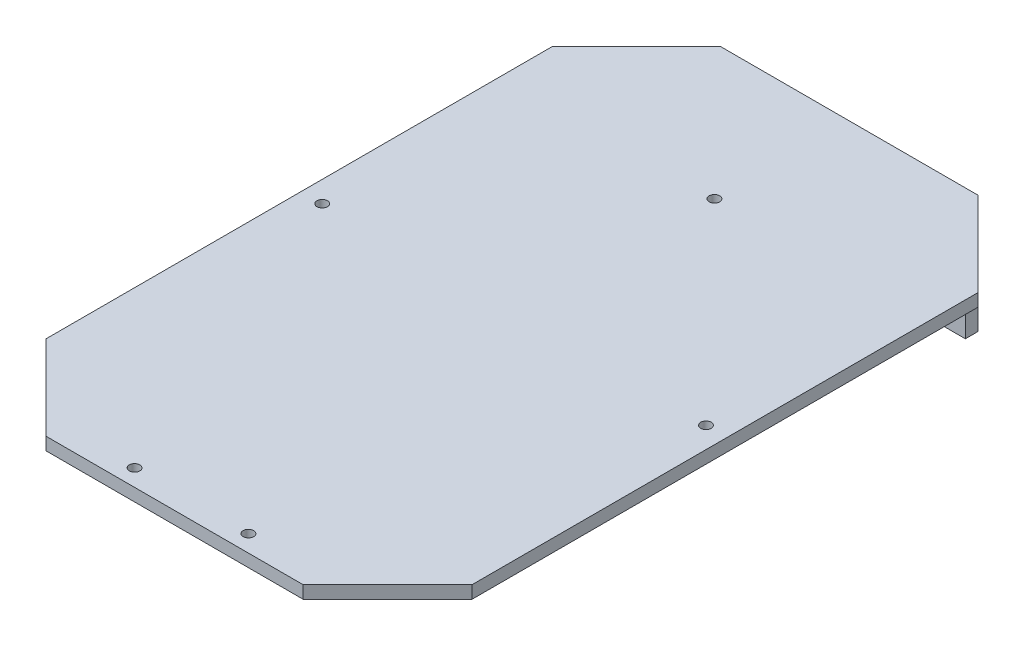
ISO-10303-21;
HEADER;
FILE_DESCRIPTION(('STEP AP214'),'2;1');
FILE_NAME('part.step','',(''),(''),'','','');
FILE_SCHEMA(('AUTOMOTIVE_DESIGN { 1 0 10303 214 1 1 1 1 }'));
ENDSEC;
DATA;
#1=APPLICATION_CONTEXT('core data for automotive mechanical design processes');
#2=APPLICATION_PROTOCOL_DEFINITION('international standard','automotive_design',2000,#1);
#3=PRODUCT_CONTEXT('',#1,'mechanical');
#4=PRODUCT('Part','Part','',(#3));
#5=PRODUCT_RELATED_PRODUCT_CATEGORY('part','',(#4));
#6=PRODUCT_DEFINITION_FORMATION('','',#4);
#7=PRODUCT_DEFINITION_CONTEXT('part definition',#1,'design');
#8=PRODUCT_DEFINITION('design','',#6,#7);
#9=PRODUCT_DEFINITION_SHAPE('','',#8);
#10=(LENGTH_UNIT() NAMED_UNIT(*) SI_UNIT(.MILLI.,.METRE.));
#11=(NAMED_UNIT(*) PLANE_ANGLE_UNIT() SI_UNIT($,.RADIAN.));
#12=(NAMED_UNIT(*) SI_UNIT($,.STERADIAN.) SOLID_ANGLE_UNIT());
#13=UNCERTAINTY_MEASURE_WITH_UNIT(LENGTH_MEASURE(1.E-05),#10,'distance_accuracy_value','');
#14=(GEOMETRIC_REPRESENTATION_CONTEXT(3) GLOBAL_UNCERTAINTY_ASSIGNED_CONTEXT((#13)) GLOBAL_UNIT_ASSIGNED_CONTEXT((#10,
#11,#12)) REPRESENTATION_CONTEXT('',''));
#15=CARTESIAN_POINT('',(0.,0.,0.));
#16=DIRECTION('',(0.,0.,1.));
#17=DIRECTION('',(1.,0.,0.));
#18=AXIS2_PLACEMENT_3D('',#15,#16,#17);
#19=CARTESIAN_POINT('',(0.,0.,0.));
#20=DIRECTION('',(0.,1.,0.));
#21=DIRECTION('',(0.,0.,1.));
#22=AXIS2_PLACEMENT_3D('',#19,#20,#21);
#23=PLANE('',#22);
#24=CARTESIAN_POINT('',(15.2297414645355,0.,21.5463266374892));
#25=DIRECTION('',(0.,1.,0.));
#26=DIRECTION('',(0.,0.,1.));
#27=AXIS2_PLACEMENT_3D('',#24,#25,#26);
#28=CIRCLE('',#27,1.25);
#29=CARTESIAN_POINT('',(15.2297414645355,0.,22.7963266374892));
#30=VERTEX_POINT('',#29);
#31=EDGE_CURVE('E167',#30,#30,#28,.T.);
#32=ORIENTED_EDGE('',*,*,#31,.T.);
#33=EDGE_LOOP('',(#32));
#34=FACE_BOUND('',#33,.T.);
#35=CARTESIAN_POINT('',(-75.7702585354645,0.,21.5463266374893));
#36=DIRECTION('',(0.,1.,0.));
#37=DIRECTION('',(0.,0.,1.));
#38=AXIS2_PLACEMENT_3D('',#35,#36,#37);
#39=CIRCLE('',#38,1.25000000000001);
#40=CARTESIAN_POINT('',(-75.7702585354645,0.,22.7963266374893));
#41=VERTEX_POINT('',#40);
#42=EDGE_CURVE('E163',#41,#41,#39,.T.);
#43=ORIENTED_EDGE('',*,*,#42,.T.);
#44=EDGE_LOOP('',(#43));
#45=FACE_BOUND('',#44,.T.);
#46=CARTESIAN_POINT('',(-30.2702585354645,0.,-25.9536733625108));
#47=DIRECTION('',(0.,1.,0.));
#48=DIRECTION('',(0.,0.,1.));
#49=AXIS2_PLACEMENT_3D('',#46,#47,#48);
#50=CIRCLE('',#49,1.25);
#51=CARTESIAN_POINT('',(-30.2702585354645,0.,-24.7036733625108));
#52=VERTEX_POINT('',#51);
#53=EDGE_CURVE('E159',#52,#52,#50,.T.);
#54=ORIENTED_EDGE('',*,*,#53,.T.);
#55=EDGE_LOOP('',(#54));
#56=FACE_BOUND('',#55,.T.);
#57=CARTESIAN_POINT('',(-43.7702585354645,0.,98.0463266374892));
#58=DIRECTION('',(0.,1.,0.));
#59=DIRECTION('',(0.,0.,1.));
#60=AXIS2_PLACEMENT_3D('',#57,#58,#59);
#61=CIRCLE('',#60,1.25);
#62=CARTESIAN_POINT('',(-43.7702585354645,0.,99.2963266374892));
#63=VERTEX_POINT('',#62);
#64=EDGE_CURVE('E155',#63,#63,#61,.T.);
#65=ORIENTED_EDGE('',*,*,#64,.T.);
#66=EDGE_LOOP('',(#65));
#67=FACE_BOUND('',#66,.T.);
#68=CARTESIAN_POINT('',(-16.7702585354645,0.,98.0463266374892));
#69=DIRECTION('',(0.,1.,0.));
#70=DIRECTION('',(0.,0.,1.));
#71=AXIS2_PLACEMENT_3D('',#68,#69,#70);
#72=CIRCLE('',#71,1.25);
#73=CARTESIAN_POINT('',(-16.7702585354645,0.,99.2963266374892));
#74=VERTEX_POINT('',#73);
#75=EDGE_CURVE('E146',#74,#74,#72,.T.);
#76=ORIENTED_EDGE('',*,*,#75,.T.);
#77=EDGE_LOOP('',(#76));
#78=FACE_BOUND('',#77,.T.);
#79=DIRECTION('',(0.,0.,1.));
#80=VECTOR('',#79,1.);
#81=CARTESIAN_POINT('',(0.22974146453553,0.,-57.9536733625108));
#82=LINE('',#81,#80);
#83=CARTESIAN_POINT('',(0.22974146453553,0.,-57.9536733625108));
#84=VERTEX_POINT('',#83);
#85=CARTESIAN_POINT('',(0.22974146453553,0.,-54.9536733625107));
#86=VERTEX_POINT('',#85);
#87=EDGE_CURVE('E142',#84,#86,#82,.T.);
#88=ORIENTED_EDGE('',*,*,#87,.F.);
#89=DIRECTION('',(-0.707106781186547,0.,-0.707106781186549));
#90=VECTOR('',#89,1.);
#91=CARTESIAN_POINT('',(0.229741464535541,0.,-57.9536733625108));
#92=LINE('',#91,#90);
#93=CARTESIAN_POINT('',(20.2297414645355,0.,-37.9536733625107));
#94=VERTEX_POINT('',#93);
#95=EDGE_CURVE('E205',#84,#94,#92,.F.);
#96=ORIENTED_EDGE('',*,*,#95,.T.);
#97=DIRECTION('',(0.,0.,-1.));
#98=VECTOR('',#97,1.);
#99=CARTESIAN_POINT('',(20.2297414645355,0.,-57.9536733625108));
#100=LINE('',#99,#98);
#101=CARTESIAN_POINT('',(20.2297414645355,0.,82.0463266374892));
#102=VERTEX_POINT('',#101);
#103=EDGE_CURVE('E172',#102,#94,#100,.T.);
#104=ORIENTED_EDGE('',*,*,#103,.F.);
#105=DIRECTION('',(0.707106781186549,0.,-0.707106781186547));
#106=VECTOR('',#105,1.);
#107=CARTESIAN_POINT('',(20.2297414645355,0.,82.0463266374893));
#108=LINE('',#107,#106);
#109=CARTESIAN_POINT('',(0.229741464535457,0.,102.046326637489));
#110=VERTEX_POINT('',#109);
#111=EDGE_CURVE('E207',#102,#110,#108,.F.);
#112=ORIENTED_EDGE('',*,*,#111,.T.);
#113=DIRECTION('',(1.,0.,0.));
#114=VECTOR('',#113,1.);
#115=CARTESIAN_POINT('',(-80.7702585354645,0.,102.046326637489));
#116=LINE('',#115,#114);
#117=CARTESIAN_POINT('',(-60.7702585354644,0.,102.046326637489));
#118=VERTEX_POINT('',#117);
#119=EDGE_CURVE('E184',#118,#110,#116,.T.);
#120=ORIENTED_EDGE('',*,*,#119,.F.);
#121=DIRECTION('',(0.707106781186547,0.,0.707106781186549));
#122=VECTOR('',#121,1.);
#123=CARTESIAN_POINT('',(-60.7702585354644,0.,102.046326637489));
#124=LINE('',#123,#122);
#125=CARTESIAN_POINT('',(-80.7702585354645,0.,82.0463266374892));
#126=VERTEX_POINT('',#125);
#127=EDGE_CURVE('E209',#118,#126,#124,.F.);
#128=ORIENTED_EDGE('',*,*,#127,.T.);
#129=DIRECTION('',(0.,0.,1.));
#130=VECTOR('',#129,1.);
#131=CARTESIAN_POINT('',(-80.7702585354645,0.,-57.9536733625108));
#132=LINE('',#131,#130);
#133=CARTESIAN_POINT('',(-80.7702585354645,0.,-37.9536733625108));
#134=VERTEX_POINT('',#133);
#135=EDGE_CURVE('E181',#134,#126,#132,.T.);
#136=ORIENTED_EDGE('',*,*,#135,.F.);
#137=DIRECTION('',(-0.707106781186549,0.,0.707106781186547));
#138=VECTOR('',#137,1.);
#139=CARTESIAN_POINT('',(-80.7702585354645,0.,-37.9536733625108));
#140=LINE('',#139,#138);
#141=CARTESIAN_POINT('',(-60.7702585354644,0.,-57.9536733625108));
#142=VERTEX_POINT('',#141);
#143=EDGE_CURVE('E203',#134,#142,#140,.F.);
#144=ORIENTED_EDGE('',*,*,#143,.T.);
#145=DIRECTION('',(0.,0.,-1.));
#146=VECTOR('',#145,1.);
#147=CARTESIAN_POINT('',(-60.7702585354644,0.,-57.9536733625108));
#148=LINE('',#147,#146);
#149=CARTESIAN_POINT('',(-60.7702585354644,0.,-54.9536733625108));
#150=VERTEX_POINT('',#149);
#151=EDGE_CURVE('E139',#150,#142,#148,.T.);
#152=ORIENTED_EDGE('',*,*,#151,.F.);
#153=DIRECTION('',(-1.,0.,0.));
#154=VECTOR('',#153,1.);
#155=CARTESIAN_POINT('',(0.22974146453553,0.,-54.9536733625107));
#156=LINE('',#155,#154);
#157=EDGE_CURVE('E51',#86,#150,#156,.T.);
#158=ORIENTED_EDGE('',*,*,#157,.F.);
#159=EDGE_LOOP('',(#88,#96,#104,#112,#120,#128,#136,#144,#152,#158));
#160=FACE_BOUND('',#159,.T.);
#161=ADVANCED_FACE('F34',(#34,#45,#56,#67,#78,#160),#23,.F.);
#162=CARTESIAN_POINT('',(-80.7702585354645,3.,-57.9536733625108));
#163=DIRECTION('',(1.,0.,0.));
#164=DIRECTION('',(0.,0.,-1.));
#165=AXIS2_PLACEMENT_3D('',#162,#163,#164);
#166=PLANE('',#165);
#167=ORIENTED_EDGE('',*,*,#135,.T.);
#168=DIRECTION('',(0.,1.,0.));
#169=VECTOR('',#168,1.);
#170=CARTESIAN_POINT('',(-80.7702585354645,3.,82.0463266374892));
#171=LINE('',#170,#169);
#172=CARTESIAN_POINT('',(-80.7702585354645,3.,82.0463266374892));
#173=VERTEX_POINT('',#172);
#174=EDGE_CURVE('E214',#126,#173,#171,.T.);
#175=ORIENTED_EDGE('',*,*,#174,.T.);
#176=DIRECTION('',(0.,0.,1.));
#177=VECTOR('',#176,1.);
#178=CARTESIAN_POINT('',(-80.7702585354645,3.,-57.9536733625108));
#179=LINE('',#178,#177);
#180=CARTESIAN_POINT('',(-80.7702585354645,3.,-37.9536733625108));
#181=VERTEX_POINT('',#180);
#182=EDGE_CURVE('E168',#181,#173,#179,.T.);
#183=ORIENTED_EDGE('',*,*,#182,.F.);
#184=DIRECTION('',(0.,-1.,0.));
#185=VECTOR('',#184,1.);
#186=CARTESIAN_POINT('',(-80.7702585354645,3.,-37.9536733625108));
#187=LINE('',#186,#185);
#188=EDGE_CURVE('E211',#181,#134,#187,.T.);
#189=ORIENTED_EDGE('',*,*,#188,.T.);
#190=EDGE_LOOP('',(#167,#175,#183,#189));
#191=FACE_BOUND('',#190,.T.);
#192=ADVANCED_FACE('F274',(#191),#166,.F.);
#193=CARTESIAN_POINT('',(-80.7702585354645,3.,102.046326637489));
#194=DIRECTION('',(0.,0.,-1.));
#195=DIRECTION('',(-1.,0.,0.));
#196=AXIS2_PLACEMENT_3D('',#193,#194,#195);
#197=PLANE('',#196);
#198=DIRECTION('',(1.,0.,0.));
#199=VECTOR('',#198,1.);
#200=CARTESIAN_POINT('',(-80.7702585354645,3.,102.046326637489));
#201=LINE('',#200,#199);
#202=CARTESIAN_POINT('',(-60.7702585354645,3.,102.046326637489));
#203=VERTEX_POINT('',#202);
#204=CARTESIAN_POINT('',(0.229741464535426,3.,102.046326637489));
#205=VERTEX_POINT('',#204);
#206=EDGE_CURVE('E171',#203,#205,#201,.T.);
#207=ORIENTED_EDGE('',*,*,#206,.F.);
#208=DIRECTION('',(0.,-1.,0.));
#209=VECTOR('',#208,1.);
#210=CARTESIAN_POINT('',(-60.7702585354644,3.,102.046326637489));
#211=LINE('',#210,#209);
#212=EDGE_CURVE('E200',#203,#118,#211,.T.);
#213=ORIENTED_EDGE('',*,*,#212,.T.);
#214=ORIENTED_EDGE('',*,*,#119,.T.);
#215=DIRECTION('',(0.,1.,0.));
#216=VECTOR('',#215,1.);
#217=CARTESIAN_POINT('',(0.229741464535485,3.,102.046326637489));
#218=LINE('',#217,#216);
#219=EDGE_CURVE('E180',#110,#205,#218,.T.);
#220=ORIENTED_EDGE('',*,*,#219,.T.);
#221=EDGE_LOOP('',(#207,#213,#214,#220));
#222=FACE_BOUND('',#221,.T.);
#223=ADVANCED_FACE('F282',(#222),#197,.F.);
#224=CARTESIAN_POINT('',(20.2297414645355,3.,-57.9536733625108));
#225=DIRECTION('',(-1.,0.,0.));
#226=DIRECTION('',(0.,0.,1.));
#227=AXIS2_PLACEMENT_3D('',#224,#225,#226);
#228=PLANE('',#227);
#229=DIRECTION('',(0.,0.,-1.));
#230=VECTOR('',#229,1.);
#231=CARTESIAN_POINT('',(20.2297414645355,3.,-57.9536733625108));
#232=LINE('',#231,#230);
#233=CARTESIAN_POINT('',(20.2297414645355,3.,82.0463266374892));
#234=VERTEX_POINT('',#233);
#235=CARTESIAN_POINT('',(20.2297414645355,3.,-37.9536733625107));
#236=VERTEX_POINT('',#235);
#237=EDGE_CURVE('E175',#234,#236,#232,.T.);
#238=ORIENTED_EDGE('',*,*,#237,.F.);
#239=DIRECTION('',(0.,-1.,0.));
#240=VECTOR('',#239,1.);
#241=CARTESIAN_POINT('',(20.2297414645355,3.,82.0463266374893));
#242=LINE('',#241,#240);
#243=EDGE_CURVE('E226',#234,#102,#242,.T.);
#244=ORIENTED_EDGE('',*,*,#243,.T.);
#245=ORIENTED_EDGE('',*,*,#103,.T.);
#246=DIRECTION('',(0.,1.,0.));
#247=VECTOR('',#246,1.);
#248=CARTESIAN_POINT('',(20.2297414645355,3.,-37.9536733625107));
#249=LINE('',#248,#247);
#250=EDGE_CURVE('E224',#94,#236,#249,.T.);
#251=ORIENTED_EDGE('',*,*,#250,.T.);
#252=EDGE_LOOP('',(#238,#244,#245,#251));
#253=FACE_BOUND('',#252,.T.);
#254=ADVANCED_FACE('F291',(#253),#228,.F.);
#255=CARTESIAN_POINT('',(-80.7702585354645,3.,-57.9536733625108));
#256=DIRECTION('',(0.,0.,1.));
#257=DIRECTION('',(1.,0.,0.));
#258=AXIS2_PLACEMENT_3D('',#255,#256,#257);
#259=PLANE('',#258);
#260=CARTESIAN_POINT('',(-50.7702585354644,-5.5,-57.9536733625108));
#261=DIRECTION('',(0.,0.,-1.));
#262=DIRECTION('',(1.,0.,0.));
#263=AXIS2_PLACEMENT_3D('',#260,#261,#262);
#264=CIRCLE('',#263,0.499999999999999);
#265=CARTESIAN_POINT('',(-50.2702585354644,-5.5,-57.9536733625108));
#266=VERTEX_POINT('',#265);
#267=EDGE_CURVE('E249',#266,#266,#264,.T.);
#268=ORIENTED_EDGE('',*,*,#267,.F.);
#269=EDGE_LOOP('',(#268));
#270=FACE_BOUND('',#269,.T.);
#271=CARTESIAN_POINT('',(-9.77025853546447,-21.,-57.9536733625108));
#272=DIRECTION('',(0.,0.,-1.));
#273=DIRECTION('',(-1.,0.,0.));
#274=AXIS2_PLACEMENT_3D('',#271,#272,#273);
#275=CIRCLE('',#274,0.499999999999999);
#276=CARTESIAN_POINT('',(-10.2702585354645,-21.,-57.9536733625108));
#277=VERTEX_POINT('',#276);
#278=EDGE_CURVE('E239',#277,#277,#275,.T.);
#279=ORIENTED_EDGE('',*,*,#278,.F.);
#280=EDGE_LOOP('',(#279));
#281=FACE_BOUND('',#280,.T.);
#282=CARTESIAN_POINT('',(-50.7702585354644,-21.,-57.9536733625108));
#283=DIRECTION('',(0.,0.,-1.));
#284=DIRECTION('',(1.,0.,0.));
#285=AXIS2_PLACEMENT_3D('',#282,#283,#284);
#286=CIRCLE('',#285,0.499999999999999);
#287=CARTESIAN_POINT('',(-50.2702585354644,-21.,-57.9536733625108));
#288=VERTEX_POINT('',#287);
#289=EDGE_CURVE('E236',#288,#288,#286,.T.);
#290=ORIENTED_EDGE('',*,*,#289,.F.);
#291=EDGE_LOOP('',(#290));
#292=FACE_BOUND('',#291,.T.);
#293=CARTESIAN_POINT('',(-9.77025853546447,-5.5,-57.9536733625108));
#294=DIRECTION('',(0.,0.,-1.));
#295=DIRECTION('',(-1.,0.,0.));
#296=AXIS2_PLACEMENT_3D('',#293,#294,#295);
#297=CIRCLE('',#296,0.499999999999999);
#298=CARTESIAN_POINT('',(-10.2702585354645,-5.5,-57.9536733625108));
#299=VERTEX_POINT('',#298);
#300=EDGE_CURVE('E233',#299,#299,#297,.T.);
#301=ORIENTED_EDGE('',*,*,#300,.F.);
#302=EDGE_LOOP('',(#301));
#303=FACE_BOUND('',#302,.T.);
#304=DIRECTION('',(-1.,0.,0.));
#305=VECTOR('',#304,1.);
#306=CARTESIAN_POINT('',(-80.7702585354645,3.,-57.9536733625108));
#307=LINE('',#306,#305);
#308=CARTESIAN_POINT('',(0.229741464535508,3.,-57.9536733625108));
#309=VERTEX_POINT('',#308);
#310=CARTESIAN_POINT('',(-60.7702585354644,3.,-57.9536733625108));
#311=VERTEX_POINT('',#310);
#312=EDGE_CURVE('E178',#309,#311,#307,.T.);
#313=ORIENTED_EDGE('',*,*,#312,.F.);
#314=DIRECTION('',(0.,-1.,0.));
#315=VECTOR('',#314,1.);
#316=CARTESIAN_POINT('',(0.229741464535541,3.,-57.9536733625108));
#317=LINE('',#316,#315);
#318=EDGE_CURVE('E11',#309,#84,#317,.T.);
#319=ORIENTED_EDGE('',*,*,#318,.T.);
#320=DIRECTION('',(0.,1.,0.));
#321=VECTOR('',#320,1.);
#322=CARTESIAN_POINT('',(0.22974146453553,-25.,-57.9536733625108));
#323=LINE('',#322,#321);
#324=CARTESIAN_POINT('',(0.22974146453553,-25.,-57.9536733625108));
#325=VERTEX_POINT('',#324);
#326=EDGE_CURVE('E256',#325,#84,#323,.T.);
#327=ORIENTED_EDGE('',*,*,#326,.F.);
#328=DIRECTION('',(1.,0.,0.));
#329=VECTOR('',#328,1.);
#330=CARTESIAN_POINT('',(0.22974146453553,-25.,-57.9536733625108));
#331=LINE('',#330,#329);
#332=CARTESIAN_POINT('',(-60.7702585354644,-25.,-57.9536733625108));
#333=VERTEX_POINT('',#332);
#334=EDGE_CURVE('E135',#333,#325,#331,.T.);
#335=ORIENTED_EDGE('',*,*,#334,.F.);
#336=DIRECTION('',(0.,1.,0.));
#337=VECTOR('',#336,1.);
#338=CARTESIAN_POINT('',(-60.7702585354644,-25.,-57.9536733625108));
#339=LINE('',#338,#337);
#340=EDGE_CURVE('E148',#333,#142,#339,.T.);
#341=ORIENTED_EDGE('',*,*,#340,.T.);
#342=DIRECTION('',(0.,1.,0.));
#343=VECTOR('',#342,1.);
#344=CARTESIAN_POINT('',(-60.7702585354644,3.,-57.9536733625108));
#345=LINE('',#344,#343);
#346=EDGE_CURVE('E43',#142,#311,#345,.T.);
#347=ORIENTED_EDGE('',*,*,#346,.T.);
#348=EDGE_LOOP('',(#313,#319,#327,#335,#341,#347));
#349=FACE_BOUND('',#348,.T.);
#350=ADVANCED_FACE('F262',(#270,#281,#292,#303,#349),#259,.F.);
#351=CARTESIAN_POINT('',(0.,3.,0.));
#352=DIRECTION('',(0.,1.,0.));
#353=DIRECTION('',(0.,0.,1.));
#354=AXIS2_PLACEMENT_3D('',#351,#352,#353);
#355=PLANE('',#354);
#356=CARTESIAN_POINT('',(-16.7702585354645,3.,98.0463266374892));
#357=DIRECTION('',(0.,1.,0.));
#358=DIRECTION('',(0.,0.,-1.));
#359=AXIS2_PLACEMENT_3D('',#356,#357,#358);
#360=CIRCLE('',#359,1.25);
#361=CARTESIAN_POINT('',(-16.7702585354645,3.,96.7963266374892));
#362=VERTEX_POINT('',#361);
#363=EDGE_CURVE('E143',#362,#362,#360,.T.);
#364=ORIENTED_EDGE('',*,*,#363,.F.);
#365=EDGE_LOOP('',(#364));
#366=FACE_BOUND('',#365,.T.);
#367=CARTESIAN_POINT('',(-43.7702585354645,3.,98.0463266374892));
#368=DIRECTION('',(0.,1.,0.));
#369=DIRECTION('',(0.,0.,1.));
#370=AXIS2_PLACEMENT_3D('',#367,#368,#369);
#371=CIRCLE('',#370,1.25);
#372=CARTESIAN_POINT('',(-43.7702585354645,3.,99.2963266374892));
#373=VERTEX_POINT('',#372);
#374=EDGE_CURVE('E152',#373,#373,#371,.T.);
#375=ORIENTED_EDGE('',*,*,#374,.F.);
#376=EDGE_LOOP('',(#375));
#377=FACE_BOUND('',#376,.T.);
#378=CARTESIAN_POINT('',(-30.2702585354645,3.,-25.9536733625108));
#379=DIRECTION('',(0.,1.,0.));
#380=DIRECTION('',(0.,0.,1.));
#381=AXIS2_PLACEMENT_3D('',#378,#379,#380);
#382=CIRCLE('',#381,1.25);
#383=CARTESIAN_POINT('',(-30.2702585354645,3.,-24.7036733625108));
#384=VERTEX_POINT('',#383);
#385=EDGE_CURVE('E156',#384,#384,#382,.T.);
#386=ORIENTED_EDGE('',*,*,#385,.F.);
#387=EDGE_LOOP('',(#386));
#388=FACE_BOUND('',#387,.T.);
#389=CARTESIAN_POINT('',(-75.7702585354645,3.,21.5463266374893));
#390=DIRECTION('',(0.,1.,0.));
#391=DIRECTION('',(0.,0.,-1.));
#392=AXIS2_PLACEMENT_3D('',#389,#390,#391);
#393=CIRCLE('',#392,1.25000000000001);
#394=CARTESIAN_POINT('',(-75.7702585354645,3.,20.2963266374892));
#395=VERTEX_POINT('',#394);
#396=EDGE_CURVE('E160',#395,#395,#393,.T.);
#397=ORIENTED_EDGE('',*,*,#396,.F.);
#398=EDGE_LOOP('',(#397));
#399=FACE_BOUND('',#398,.T.);
#400=CARTESIAN_POINT('',(15.2297414645355,3.,21.5463266374892));
#401=DIRECTION('',(0.,1.,0.));
#402=DIRECTION('',(0.,0.,1.));
#403=AXIS2_PLACEMENT_3D('',#400,#401,#402);
#404=CIRCLE('',#403,1.25);
#405=CARTESIAN_POINT('',(15.2297414645355,3.,22.7963266374892));
#406=VERTEX_POINT('',#405);
#407=EDGE_CURVE('E164',#406,#406,#404,.T.);
#408=ORIENTED_EDGE('',*,*,#407,.F.);
#409=EDGE_LOOP('',(#408));
#410=FACE_BOUND('',#409,.T.);
#411=ORIENTED_EDGE('',*,*,#182,.T.);
#412=DIRECTION('',(-0.707106781186547,0.,-0.707106781186549));
#413=VECTOR('',#412,1.);
#414=CARTESIAN_POINT('',(-81.4082925864769,3.,81.4082925864767));
#415=LINE('',#414,#413);
#416=EDGE_CURVE('E222',#173,#203,#415,.F.);
#417=ORIENTED_EDGE('',*,*,#416,.T.);
#418=ORIENTED_EDGE('',*,*,#206,.T.);
#419=DIRECTION('',(-0.707106781186549,0.,0.707106781186547));
#420=VECTOR('',#419,1.);
#421=CARTESIAN_POINT('',(51.1380340510124,3.,51.1380340510125));
#422=LINE('',#421,#420);
#423=EDGE_CURVE('E220',#205,#234,#422,.F.);
#424=ORIENTED_EDGE('',*,*,#423,.T.);
#425=ORIENTED_EDGE('',*,*,#237,.T.);
#426=DIRECTION('',(0.707106781186547,0.,0.707106781186549));
#427=VECTOR('',#426,1.);
#428=CARTESIAN_POINT('',(29.0917074135231,3.,-29.0917074135231));
#429=LINE('',#428,#427);
#430=EDGE_CURVE('E218',#236,#309,#429,.F.);
#431=ORIENTED_EDGE('',*,*,#430,.T.);
#432=ORIENTED_EDGE('',*,*,#312,.T.);
#433=DIRECTION('',(0.707106781186549,0.,-0.707106781186547));
#434=VECTOR('',#433,1.);
#435=CARTESIAN_POINT('',(-59.3619659489875,3.,-59.3619659489877));
#436=LINE('',#435,#434);
#437=EDGE_CURVE('E216',#311,#181,#436,.F.);
#438=ORIENTED_EDGE('',*,*,#437,.T.);
#439=EDGE_LOOP('',(#411,#417,#418,#424,#425,#431,#432,#438));
#440=FACE_BOUND('',#439,.T.);
#441=ADVANCED_FACE('F271',(#366,#377,#388,#399,#410,#440),#355,.T.);
#442=CARTESIAN_POINT('',(15.2297414645355,-137.,21.5463266374892));
#443=DIRECTION('',(0.,1.,0.));
#444=DIRECTION('',(0.,0.,1.));
#445=AXIS2_PLACEMENT_3D('',#442,#443,#444);
#446=CYLINDRICAL_SURFACE('',#445,1.25);
#447=ORIENTED_EDGE('',*,*,#407,.T.);
#448=EDGE_LOOP('',(#447));
#449=FACE_BOUND('',#448,.T.);
#450=ORIENTED_EDGE('',*,*,#31,.F.);
#451=EDGE_LOOP('',(#450));
#452=FACE_BOUND('',#451,.T.);
#453=ADVANCED_FACE('F345',(#449,#452),#446,.F.);
#454=CARTESIAN_POINT('',(-75.7702585354645,-137.,21.5463266374893));
#455=DIRECTION('',(0.,1.,0.));
#456=DIRECTION('',(0.,0.,1.));
#457=AXIS2_PLACEMENT_3D('',#454,#455,#456);
#458=CYLINDRICAL_SURFACE('',#457,1.25000000000001);
#459=ORIENTED_EDGE('',*,*,#396,.T.);
#460=EDGE_LOOP('',(#459));
#461=FACE_BOUND('',#460,.T.);
#462=ORIENTED_EDGE('',*,*,#42,.F.);
#463=EDGE_LOOP('',(#462));
#464=FACE_BOUND('',#463,.T.);
#465=ADVANCED_FACE('F342',(#461,#464),#458,.F.);
#466=CARTESIAN_POINT('',(-30.2702585354645,-137.,-25.9536733625108));
#467=DIRECTION('',(0.,1.,0.));
#468=DIRECTION('',(0.,0.,1.));
#469=AXIS2_PLACEMENT_3D('',#466,#467,#468);
#470=CYLINDRICAL_SURFACE('',#469,1.25);
#471=ORIENTED_EDGE('',*,*,#385,.T.);
#472=EDGE_LOOP('',(#471));
#473=FACE_BOUND('',#472,.T.);
#474=ORIENTED_EDGE('',*,*,#53,.F.);
#475=EDGE_LOOP('',(#474));
#476=FACE_BOUND('',#475,.T.);
#477=ADVANCED_FACE('F333',(#473,#476),#470,.F.);
#478=CARTESIAN_POINT('',(-43.7702585354645,-137.,98.0463266374892));
#479=DIRECTION('',(0.,1.,0.));
#480=DIRECTION('',(0.,0.,1.));
#481=AXIS2_PLACEMENT_3D('',#478,#479,#480);
#482=CYLINDRICAL_SURFACE('',#481,1.25);
#483=ORIENTED_EDGE('',*,*,#374,.T.);
#484=EDGE_LOOP('',(#483));
#485=FACE_BOUND('',#484,.T.);
#486=ORIENTED_EDGE('',*,*,#64,.F.);
#487=EDGE_LOOP('',(#486));
#488=FACE_BOUND('',#487,.T.);
#489=ADVANCED_FACE('F327',(#485,#488),#482,.F.);
#490=CARTESIAN_POINT('',(-16.7702585354645,-137.,98.0463266374892));
#491=DIRECTION('',(0.,1.,0.));
#492=DIRECTION('',(0.,0.,1.));
#493=AXIS2_PLACEMENT_3D('',#490,#491,#492);
#494=CYLINDRICAL_SURFACE('',#493,1.25);
#495=ORIENTED_EDGE('',*,*,#363,.T.);
#496=EDGE_LOOP('',(#495));
#497=FACE_BOUND('',#496,.T.);
#498=ORIENTED_EDGE('',*,*,#75,.F.);
#499=EDGE_LOOP('',(#498));
#500=FACE_BOUND('',#499,.T.);
#501=ADVANCED_FACE('F323',(#497,#500),#494,.F.);
#502=CARTESIAN_POINT('',(-60.7702585354644,3.,102.046326637489));
#503=DIRECTION('',(0.707106781186549,0.,-0.707106781186547));
#504=DIRECTION('',(0.,-1.,0.));
#505=AXIS2_PLACEMENT_3D('',#502,#503,#504);
#506=PLANE('',#505);
#507=ORIENTED_EDGE('',*,*,#416,.F.);
#508=ORIENTED_EDGE('',*,*,#174,.F.);
#509=ORIENTED_EDGE('',*,*,#127,.F.);
#510=ORIENTED_EDGE('',*,*,#212,.F.);
#511=EDGE_LOOP('',(#507,#508,#509,#510));
#512=FACE_BOUND('',#511,.T.);
#513=ADVANCED_FACE('F277',(#512),#506,.F.);
#514=CARTESIAN_POINT('',(20.2297414645355,3.,82.0463266374893));
#515=DIRECTION('',(-0.707106781186546,0.,-0.707106781186548));
#516=DIRECTION('',(0.,-1.,0.));
#517=AXIS2_PLACEMENT_3D('',#514,#515,#516);
#518=PLANE('',#517);
#519=ORIENTED_EDGE('',*,*,#423,.F.);
#520=ORIENTED_EDGE('',*,*,#219,.F.);
#521=ORIENTED_EDGE('',*,*,#111,.F.);
#522=ORIENTED_EDGE('',*,*,#243,.F.);
#523=EDGE_LOOP('',(#519,#520,#521,#522));
#524=FACE_BOUND('',#523,.T.);
#525=ADVANCED_FACE('F286',(#524),#518,.F.);
#526=CARTESIAN_POINT('',(0.229741464535541,3.,-57.9536733625108));
#527=DIRECTION('',(-0.707106781186548,0.,0.707106781186546));
#528=DIRECTION('',(0.,-1.,0.));
#529=AXIS2_PLACEMENT_3D('',#526,#527,#528);
#530=PLANE('',#529);
#531=ORIENTED_EDGE('',*,*,#430,.F.);
#532=ORIENTED_EDGE('',*,*,#250,.F.);
#533=ORIENTED_EDGE('',*,*,#95,.F.);
#534=ORIENTED_EDGE('',*,*,#318,.F.);
#535=EDGE_LOOP('',(#531,#532,#533,#534));
#536=FACE_BOUND('',#535,.T.);
#537=ADVANCED_FACE('F296',(#536),#530,.F.);
#538=CARTESIAN_POINT('',(-80.7702585354645,3.,-37.9536733625108));
#539=DIRECTION('',(0.707106781186546,0.,0.707106781186548));
#540=DIRECTION('',(0.,-1.,0.));
#541=AXIS2_PLACEMENT_3D('',#538,#539,#540);
#542=PLANE('',#541);
#543=ORIENTED_EDGE('',*,*,#437,.F.);
#544=ORIENTED_EDGE('',*,*,#346,.F.);
#545=ORIENTED_EDGE('',*,*,#143,.F.);
#546=ORIENTED_EDGE('',*,*,#188,.F.);
#547=EDGE_LOOP('',(#543,#544,#545,#546));
#548=FACE_BOUND('',#547,.T.);
#549=ADVANCED_FACE('F36',(#548),#542,.F.);
#550=CARTESIAN_POINT('',(0.22974146453553,-25.,-57.9536733625108));
#551=DIRECTION('',(-1.,0.,0.));
#552=DIRECTION('',(0.,0.,1.));
#553=AXIS2_PLACEMENT_3D('',#550,#551,#552);
#554=PLANE('',#553);
#555=ORIENTED_EDGE('',*,*,#87,.T.);
#556=DIRECTION('',(0.,1.,0.));
#557=VECTOR('',#556,1.);
#558=CARTESIAN_POINT('',(0.22974146453553,-25.,-54.9536733625107));
#559=LINE('',#558,#557);
#560=CARTESIAN_POINT('',(0.22974146453553,-25.,-54.9536733625107));
#561=VERTEX_POINT('',#560);
#562=EDGE_CURVE('E123',#561,#86,#559,.T.);
#563=ORIENTED_EDGE('',*,*,#562,.F.);
#564=DIRECTION('',(0.,0.,1.));
#565=VECTOR('',#564,1.);
#566=CARTESIAN_POINT('',(0.22974146453553,-25.,-57.9536733625108));
#567=LINE('',#566,#565);
#568=EDGE_CURVE('E130',#325,#561,#567,.T.);
#569=ORIENTED_EDGE('',*,*,#568,.F.);
#570=ORIENTED_EDGE('',*,*,#326,.T.);
#571=EDGE_LOOP('',(#555,#563,#569,#570));
#572=FACE_BOUND('',#571,.T.);
#573=ADVANCED_FACE('F141',(#572),#554,.F.);
#574=CARTESIAN_POINT('',(0.22974146453553,-25.,-54.9536733625107));
#575=DIRECTION('',(0.,0.,-1.));
#576=DIRECTION('',(-1.,0.,0.));
#577=AXIS2_PLACEMENT_3D('',#574,#575,#576);
#578=PLANE('',#577);
#579=CARTESIAN_POINT('',(-50.7702585354644,-5.5,-54.9536733625108));
#580=DIRECTION('',(0.,0.,-1.));
#581=DIRECTION('',(-1.,0.,0.));
#582=AXIS2_PLACEMENT_3D('',#579,#580,#581);
#583=CIRCLE('',#582,0.499999999999999);
#584=CARTESIAN_POINT('',(-51.2702585354644,-5.5,-54.9536733625108));
#585=VERTEX_POINT('',#584);
#586=EDGE_CURVE('E38',#585,#585,#583,.T.);
#587=ORIENTED_EDGE('',*,*,#586,.T.);
#588=EDGE_LOOP('',(#587));
#589=FACE_BOUND('',#588,.T.);
#590=CARTESIAN_POINT('',(-9.77025853546447,-21.,-54.9536733625107));
#591=DIRECTION('',(0.,0.,-1.));
#592=DIRECTION('',(-1.,0.,0.));
#593=AXIS2_PLACEMENT_3D('',#590,#591,#592);
#594=CIRCLE('',#593,0.499999999999999);
#595=CARTESIAN_POINT('',(-10.2702585354645,-21.,-54.9536733625107));
#596=VERTEX_POINT('',#595);
#597=EDGE_CURVE('E237',#596,#596,#594,.T.);
#598=ORIENTED_EDGE('',*,*,#597,.T.);
#599=EDGE_LOOP('',(#598));
#600=FACE_BOUND('',#599,.T.);
#601=CARTESIAN_POINT('',(-50.7702585354644,-21.,-54.9536733625108));
#602=DIRECTION('',(0.,0.,-1.));
#603=DIRECTION('',(-1.,0.,0.));
#604=AXIS2_PLACEMENT_3D('',#601,#602,#603);
#605=CIRCLE('',#604,0.499999999999999);
#606=CARTESIAN_POINT('',(-51.2702585354644,-21.,-54.9536733625108));
#607=VERTEX_POINT('',#606);
#608=EDGE_CURVE('E234',#607,#607,#605,.T.);
#609=ORIENTED_EDGE('',*,*,#608,.T.);
#610=EDGE_LOOP('',(#609));
#611=FACE_BOUND('',#610,.T.);
#612=CARTESIAN_POINT('',(-9.77025853546447,-5.5,-54.9536733625107));
#613=DIRECTION('',(0.,0.,-1.));
#614=DIRECTION('',(-1.,0.,0.));
#615=AXIS2_PLACEMENT_3D('',#612,#613,#614);
#616=CIRCLE('',#615,0.499999999999999);
#617=CARTESIAN_POINT('',(-10.2702585354645,-5.5,-54.9536733625107));
#618=VERTEX_POINT('',#617);
#619=EDGE_CURVE('E230',#618,#618,#616,.T.);
#620=ORIENTED_EDGE('',*,*,#619,.T.);
#621=EDGE_LOOP('',(#620));
#622=FACE_BOUND('',#621,.T.);
#623=ORIENTED_EDGE('',*,*,#157,.T.);
#624=DIRECTION('',(0.,1.,0.));
#625=VECTOR('',#624,1.);
#626=CARTESIAN_POINT('',(-60.7702585354644,-25.,-54.9536733625108));
#627=LINE('',#626,#625);
#628=CARTESIAN_POINT('',(-60.7702585354644,-25.,-54.9536733625108));
#629=VERTEX_POINT('',#628);
#630=EDGE_CURVE('E126',#629,#150,#627,.T.);
#631=ORIENTED_EDGE('',*,*,#630,.F.);
#632=DIRECTION('',(-1.,0.,0.));
#633=VECTOR('',#632,1.);
#634=CARTESIAN_POINT('',(0.22974146453553,-25.,-54.9536733625107));
#635=LINE('',#634,#633);
#636=EDGE_CURVE('E119',#561,#629,#635,.T.);
#637=ORIENTED_EDGE('',*,*,#636,.F.);
#638=ORIENTED_EDGE('',*,*,#562,.T.);
#639=EDGE_LOOP('',(#623,#631,#637,#638));
#640=FACE_BOUND('',#639,.T.);
#641=ADVANCED_FACE('F121',(#589,#600,#611,#622,#640),#578,.F.);
#642=CARTESIAN_POINT('',(-60.7702585354644,-25.,-57.9536733625108));
#643=DIRECTION('',(1.,0.,0.));
#644=DIRECTION('',(0.,0.,-1.));
#645=AXIS2_PLACEMENT_3D('',#642,#643,#644);
#646=PLANE('',#645);
#647=ORIENTED_EDGE('',*,*,#151,.T.);
#648=ORIENTED_EDGE('',*,*,#340,.F.);
#649=DIRECTION('',(0.,0.,-1.));
#650=VECTOR('',#649,1.);
#651=CARTESIAN_POINT('',(-60.7702585354644,-25.,-57.9536733625108));
#652=LINE('',#651,#650);
#653=EDGE_CURVE('E129',#629,#333,#652,.T.);
#654=ORIENTED_EDGE('',*,*,#653,.F.);
#655=ORIENTED_EDGE('',*,*,#630,.T.);
#656=EDGE_LOOP('',(#647,#648,#654,#655));
#657=FACE_BOUND('',#656,.T.);
#658=ADVANCED_FACE('F264',(#657),#646,.F.);
#659=CARTESIAN_POINT('',(0.,-25.,0.));
#660=DIRECTION('',(0.,-1.,0.));
#661=DIRECTION('',(0.,0.,-1.));
#662=AXIS2_PLACEMENT_3D('',#659,#660,#661);
#663=PLANE('',#662);
#664=ORIENTED_EDGE('',*,*,#568,.T.);
#665=ORIENTED_EDGE('',*,*,#636,.T.);
#666=ORIENTED_EDGE('',*,*,#653,.T.);
#667=ORIENTED_EDGE('',*,*,#334,.T.);
#668=EDGE_LOOP('',(#664,#665,#666,#667));
#669=FACE_BOUND('',#668,.T.);
#670=ADVANCED_FACE('F133',(#669),#663,.T.);
#671=CARTESIAN_POINT('',(-9.77025853546447,-5.5,-32.9536733625108));
#672=DIRECTION('',(0.,0.,-1.));
#673=DIRECTION('',(-1.,0.,0.));
#674=AXIS2_PLACEMENT_3D('',#671,#672,#673);
#675=CYLINDRICAL_SURFACE('',#674,0.499999999999999);
#676=ORIENTED_EDGE('',*,*,#300,.T.);
#677=EDGE_LOOP('',(#676));
#678=FACE_BOUND('',#677,.T.);
#679=ORIENTED_EDGE('',*,*,#619,.F.);
#680=EDGE_LOOP('',(#679));
#681=FACE_BOUND('',#680,.T.);
#682=ADVANCED_FACE('F466',(#678,#681),#675,.F.);
#683=CARTESIAN_POINT('',(-50.7702585354644,-21.,-32.9536733625108));
#684=DIRECTION('',(0.,0.,-1.));
#685=DIRECTION('',(-1.,0.,0.));
#686=AXIS2_PLACEMENT_3D('',#683,#684,#685);
#687=CYLINDRICAL_SURFACE('',#686,0.499999999999999);
#688=ORIENTED_EDGE('',*,*,#289,.T.);
#689=EDGE_LOOP('',(#688));
#690=FACE_BOUND('',#689,.T.);
#691=ORIENTED_EDGE('',*,*,#608,.F.);
#692=EDGE_LOOP('',(#691));
#693=FACE_BOUND('',#692,.T.);
#694=ADVANCED_FACE('F473',(#690,#693),#687,.F.);
#695=CARTESIAN_POINT('',(-9.77025853546447,-21.,-32.9536733625108));
#696=DIRECTION('',(0.,0.,-1.));
#697=DIRECTION('',(-1.,0.,0.));
#698=AXIS2_PLACEMENT_3D('',#695,#696,#697);
#699=CYLINDRICAL_SURFACE('',#698,0.499999999999999);
#700=ORIENTED_EDGE('',*,*,#278,.T.);
#701=EDGE_LOOP('',(#700));
#702=FACE_BOUND('',#701,.T.);
#703=ORIENTED_EDGE('',*,*,#597,.F.);
#704=EDGE_LOOP('',(#703));
#705=FACE_BOUND('',#704,.T.);
#706=ADVANCED_FACE('F482',(#702,#705),#699,.F.);
#707=CARTESIAN_POINT('',(-50.7702585354644,-5.5,-32.9536733625108));
#708=DIRECTION('',(0.,0.,-1.));
#709=DIRECTION('',(-1.,0.,0.));
#710=AXIS2_PLACEMENT_3D('',#707,#708,#709);
#711=CYLINDRICAL_SURFACE('',#710,0.499999999999999);
#712=ORIENTED_EDGE('',*,*,#267,.T.);
#713=EDGE_LOOP('',(#712));
#714=FACE_BOUND('',#713,.T.);
#715=ORIENTED_EDGE('',*,*,#586,.F.);
#716=EDGE_LOOP('',(#715));
#717=FACE_BOUND('',#716,.T.);
#718=ADVANCED_FACE('F491',(#714,#717),#711,.F.);
#719=CLOSED_SHELL('',(#161,#192,#223,#254,#350,#441,#453,#465,#477,#489,#501,#513,#525,#537,
#549,#573,#641,#658,#670,#682,#694,#706,#718));
#720=MANIFOLD_SOLID_BREP('B2',#719);
#721=ADVANCED_BREP_SHAPE_REPRESENTATION('',(#18,#720),#14);
#722=SHAPE_DEFINITION_REPRESENTATION(#9,#721);
ENDSEC;
END-ISO-10303-21;
